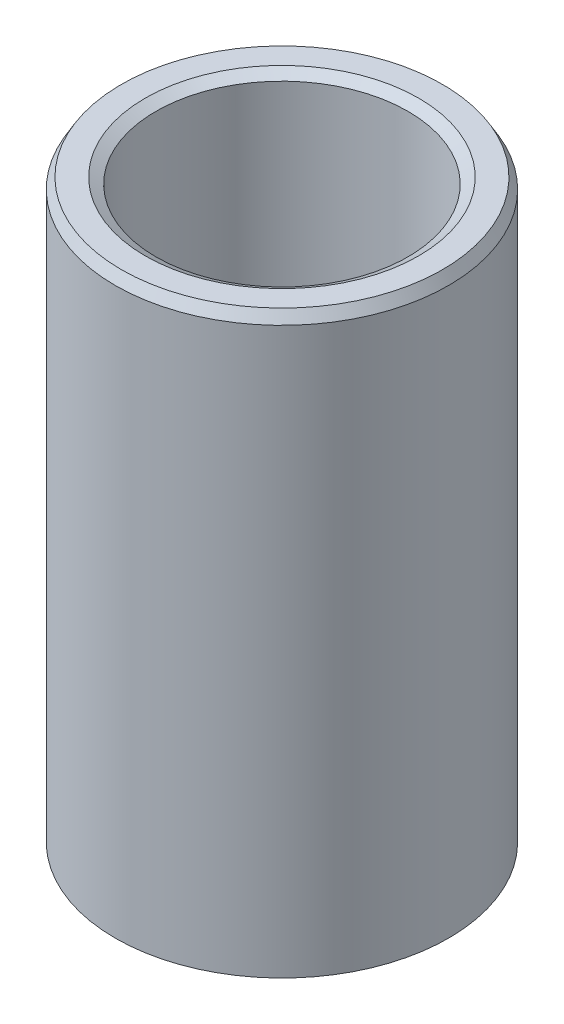
ISO-10303-21;
HEADER;
FILE_DESCRIPTION(('STEP AP214'),'2;1');
FILE_NAME('part.step','',(''),(''),'','','');
FILE_SCHEMA(('AUTOMOTIVE_DESIGN { 1 0 10303 214 1 1 1 1 }'));
ENDSEC;
DATA;
#1=APPLICATION_CONTEXT('core data for automotive mechanical design processes');
#2=APPLICATION_PROTOCOL_DEFINITION('international standard','automotive_design',2000,#1);
#3=PRODUCT_CONTEXT('',#1,'mechanical');
#4=PRODUCT('Part','Part','',(#3));
#5=PRODUCT_RELATED_PRODUCT_CATEGORY('part','',(#4));
#6=PRODUCT_DEFINITION_FORMATION('','',#4);
#7=PRODUCT_DEFINITION_CONTEXT('part definition',#1,'design');
#8=PRODUCT_DEFINITION('design','',#6,#7);
#9=PRODUCT_DEFINITION_SHAPE('','',#8);
#10=(LENGTH_UNIT() NAMED_UNIT(*) SI_UNIT(.MILLI.,.METRE.));
#11=(NAMED_UNIT(*) PLANE_ANGLE_UNIT() SI_UNIT($,.RADIAN.));
#12=(NAMED_UNIT(*) SI_UNIT($,.STERADIAN.) SOLID_ANGLE_UNIT());
#13=UNCERTAINTY_MEASURE_WITH_UNIT(LENGTH_MEASURE(1.E-05),#10,'distance_accuracy_value','');
#14=(GEOMETRIC_REPRESENTATION_CONTEXT(3) GLOBAL_UNCERTAINTY_ASSIGNED_CONTEXT((#13)) GLOBAL_UNIT_ASSIGNED_CONTEXT((#10,
#11,#12)) REPRESENTATION_CONTEXT('',''));
#15=CARTESIAN_POINT('',(0.,0.,0.));
#16=DIRECTION('',(0.,0.,1.));
#17=DIRECTION('',(1.,0.,0.));
#18=AXIS2_PLACEMENT_3D('',#15,#16,#17);
#19=CARTESIAN_POINT('',(0.,209.52216487062,0.));
#20=DIRECTION('',(0.,-1.,0.));
#21=DIRECTION('',(0.,0.,-1.));
#22=AXIS2_PLACEMENT_3D('',#19,#20,#21);
#23=CYLINDRICAL_SURFACE('',#22,60.);
#24=CARTESIAN_POINT('',(0.,2.20777962738306,0.));
#25=DIRECTION('',(0.,1.,0.));
#26=DIRECTION('',(0.,0.,1.));
#27=AXIS2_PLACEMENT_3D('',#24,#25,#26);
#28=CIRCLE('',#27,60.);
#29=CARTESIAN_POINT('',(0.,2.20777962738306,60.));
#30=VERTEX_POINT('',#29);
#31=EDGE_CURVE('E10',#30,#30,#28,.T.);
#32=ORIENTED_EDGE('',*,*,#31,.T.);
#33=EDGE_LOOP('',(#32));
#34=FACE_BOUND('',#33,.T.);
#35=CARTESIAN_POINT('',(0.,205.698178384077,0.));
#36=DIRECTION('',(0.,1.,0.));
#37=DIRECTION('',(0.,0.,1.));
#38=AXIS2_PLACEMENT_3D('',#35,#36,#37);
#39=CIRCLE('',#38,60.);
#40=CARTESIAN_POINT('',(0.,205.698178384077,60.));
#41=VERTEX_POINT('',#40);
#42=EDGE_CURVE('E50',#41,#41,#39,.F.);
#43=ORIENTED_EDGE('',*,*,#42,.T.);
#44=EDGE_LOOP('',(#43));
#45=FACE_BOUND('',#44,.T.);
#46=ADVANCED_FACE('F39',(#34,#45),#23,.T.);
#47=CARTESIAN_POINT('',(0.,209.52216487062,0.));
#48=DIRECTION('',(0.,1.,0.));
#49=DIRECTION('',(0.,0.,1.));
#50=AXIS2_PLACEMENT_3D('',#47,#48,#49);
#51=PLANE('',#50);
#52=CARTESIAN_POINT('',(0.,209.52216487062,0.));
#53=DIRECTION('',(0.,1.,0.));
#54=DIRECTION('',(0.,0.,1.));
#55=AXIS2_PLACEMENT_3D('',#52,#53,#54);
#56=CIRCLE('',#55,49.2090341574761);
#57=CARTESIAN_POINT('',(0.,209.52216487062,49.2090341574761));
#58=VERTEX_POINT('',#57);
#59=EDGE_CURVE('E58',#58,#58,#56,.F.);
#60=ORIENTED_EDGE('',*,*,#59,.T.);
#61=EDGE_LOOP('',(#60));
#62=FACE_BOUND('',#61,.T.);
#63=CARTESIAN_POINT('',(0.,209.52216487062,0.));
#64=DIRECTION('',(0.,1.,0.));
#65=DIRECTION('',(0.,0.,1.));
#66=AXIS2_PLACEMENT_3D('',#63,#64,#65);
#67=CIRCLE('',#66,57.7922203726169);
#68=CARTESIAN_POINT('',(0.,209.52216487062,57.7922203726169));
#69=VERTEX_POINT('',#68);
#70=EDGE_CURVE('E61',#69,#69,#67,.T.);
#71=ORIENTED_EDGE('',*,*,#70,.T.);
#72=EDGE_LOOP('',(#71));
#73=FACE_BOUND('',#72,.T.);
#74=ADVANCED_FACE('F88',(#62,#73),#51,.T.);
#75=CARTESIAN_POINT('',(0.,0.,0.));
#76=DIRECTION('',(0.,1.,0.));
#77=DIRECTION('',(0.,0.,1.));
#78=AXIS2_PLACEMENT_3D('',#75,#76,#77);
#79=PLANE('',#78);
#80=CARTESIAN_POINT('',(0.,0.,0.));
#81=DIRECTION('',(0.,1.,0.));
#82=DIRECTION('',(0.,0.,1.));
#83=AXIS2_PLACEMENT_3D('',#80,#81,#82);
#84=CIRCLE('',#83,47.5928272983162);
#85=CARTESIAN_POINT('',(0.,0.,-47.5928272983162));
#86=VERTEX_POINT('',#85);
#87=EDGE_CURVE('E51',#86,#86,#84,.T.);
#88=ORIENTED_EDGE('',*,*,#87,.T.);
#89=EDGE_LOOP('',(#88));
#90=FACE_BOUND('',#89,.T.);
#91=CARTESIAN_POINT('',(0.,0.,0.));
#92=DIRECTION('',(0.,1.,0.));
#93=DIRECTION('',(0.,0.,1.));
#94=AXIS2_PLACEMENT_3D('',#91,#92,#93);
#95=CIRCLE('',#94,56.176013513457);
#96=CARTESIAN_POINT('',(0.,0.,56.176013513457));
#97=VERTEX_POINT('',#96);
#98=EDGE_CURVE('E54',#97,#97,#95,.F.);
#99=ORIENTED_EDGE('',*,*,#98,.T.);
#100=EDGE_LOOP('',(#99));
#101=FACE_BOUND('',#100,.T.);
#102=ADVANCED_FACE('F83',(#90,#101),#79,.F.);
#103=CARTESIAN_POINT('',(0.,209.52216487062,0.));
#104=DIRECTION('',(0.,-1.,0.));
#105=DIRECTION('',(0.,0.,-1.));
#106=AXIS2_PLACEMENT_3D('',#103,#104,#105);
#107=CYLINDRICAL_SURFACE('',#106,45.3850476709331);
#108=CARTESIAN_POINT('',(0.,207.314385243237,0.));
#109=DIRECTION('',(0.,1.,0.));
#110=DIRECTION('',(0.,0.,1.));
#111=AXIS2_PLACEMENT_3D('',#108,#109,#110);
#112=CIRCLE('',#111,45.3850476709331);
#113=CARTESIAN_POINT('',(0.,207.314385243237,45.3850476709331));
#114=VERTEX_POINT('',#113);
#115=EDGE_CURVE('E67',#114,#114,#112,.T.);
#116=ORIENTED_EDGE('',*,*,#115,.T.);
#117=EDGE_LOOP('',(#116));
#118=FACE_BOUND('',#117,.T.);
#119=CARTESIAN_POINT('',(0.,3.82398648654297,0.));
#120=DIRECTION('',(0.,1.,0.));
#121=DIRECTION('',(0.,0.,1.));
#122=AXIS2_PLACEMENT_3D('',#119,#120,#121);
#123=CIRCLE('',#122,45.3850476709331);
#124=CARTESIAN_POINT('',(0.,3.82398648654297,-45.3850476709331));
#125=VERTEX_POINT('',#124);
#126=EDGE_CURVE('E69',#125,#125,#123,.F.);
#127=ORIENTED_EDGE('',*,*,#126,.T.);
#128=EDGE_LOOP('',(#127));
#129=FACE_BOUND('',#128,.T.);
#130=ADVANCED_FACE('F71',(#118,#129),#107,.F.);
#131=CARTESIAN_POINT('',(0.,207.314385243237,0.));
#132=DIRECTION('',(0.,1.,0.));
#133=DIRECTION('',(0.,0.,1.));
#134=AXIS2_PLACEMENT_3D('',#131,#132,#133);
#135=CONICAL_SURFACE('',#134,45.3850476709331,1.0471975511966);
#136=ORIENTED_EDGE('',*,*,#59,.F.);
#137=EDGE_LOOP('',(#136));
#138=FACE_BOUND('',#137,.T.);
#139=ORIENTED_EDGE('',*,*,#115,.F.);
#140=EDGE_LOOP('',(#139));
#141=FACE_BOUND('',#140,.T.);
#142=ADVANCED_FACE('F77',(#138,#141),#135,.F.);
#143=CARTESIAN_POINT('',(0.,0.,0.));
#144=DIRECTION('',(0.,-1.,0.));
#145=DIRECTION('',(0.,0.,-1.));
#146=AXIS2_PLACEMENT_3D('',#143,#144,#145);
#147=CONICAL_SURFACE('',#146,47.5928272983162,0.523598775598292);
#148=CARTESIAN_POINT('',(0.,3.82398648654297,-45.3850476709331));
#149=CARTESIAN_POINT('',(0.,3.78415329397482,-45.408045375385));
#150=CARTESIAN_POINT('',(0.,3.74432010140666,-45.4310430798369));
#151=CARTESIAN_POINT('',(0.,3.66465371627035,-45.4770384887407));
#152=CARTESIAN_POINT('',(0.,3.62482052370219,-45.5000361931926));
#153=CARTESIAN_POINT('',(0.,3.54515413856588,-45.5460316020965));
#154=CARTESIAN_POINT('',(0.,3.50532094599773,-45.5690293065484));
#155=CARTESIAN_POINT('',(0.,3.42565456086141,-45.6150247154522));
#156=CARTESIAN_POINT('',(0.,3.38582136829326,-45.6380224199041));
#157=CARTESIAN_POINT('',(0.,3.30615498315695,-45.6840178288079));
#158=CARTESIAN_POINT('',(0.,3.26632179058879,-45.7070155332598));
#159=CARTESIAN_POINT('',(0.,3.18665540545248,-45.7530109421636));
#160=CARTESIAN_POINT('',(0.,3.14682221288432,-45.7760086466155));
#161=CARTESIAN_POINT('',(0.,3.06715582774801,-45.8220040555193));
#162=CARTESIAN_POINT('',(0.,3.02732263517985,-45.8450017599712));
#163=CARTESIAN_POINT('',(0.,2.94765625004354,-45.8909971688751));
#164=CARTESIAN_POINT('',(0.,2.90782305747539,-45.913994873327));
#165=CARTESIAN_POINT('',(0.,2.82815667233907,-45.9599902822308));
#166=CARTESIAN_POINT('',(0.,2.78832347977092,-45.9829879866827));
#167=CARTESIAN_POINT('',(0.,2.70865709463461,-46.0289833955865));
#168=CARTESIAN_POINT('',(0.,2.66882390206645,-46.0519811000384));
#169=CARTESIAN_POINT('',(0.,2.58915751693014,-46.0979765089422));
#170=CARTESIAN_POINT('',(0.,2.54932432436198,-46.1209742133941));
#171=CARTESIAN_POINT('',(0.,2.46965793922567,-46.1669696222979));
#172=CARTESIAN_POINT('',(0.,2.42982474665751,-46.1899673267499));
#173=CARTESIAN_POINT('',(0.,2.3501583615212,-46.2359627356537));
#174=CARTESIAN_POINT('',(0.,2.31032516895305,-46.2589604401056));
#175=CARTESIAN_POINT('',(0.,2.23065878381674,-46.3049558490094));
#176=CARTESIAN_POINT('',(0.,2.19082559124858,-46.3279535534613));
#177=CARTESIAN_POINT('',(0.,2.11115920611227,-46.3739489623651));
#178=CARTESIAN_POINT('',(0.,2.07132601354411,-46.396946666817));
#179=CARTESIAN_POINT('',(0.,1.9916596284078,-46.4429420757208));
#180=CARTESIAN_POINT('',(0.,1.95182643583964,-46.4659397801727));
#181=CARTESIAN_POINT('',(0.,1.87216005070333,-46.5119351890765));
#182=CARTESIAN_POINT('',(0.,1.83232685813517,-46.5349328935284));
#183=CARTESIAN_POINT('',(0.,1.75266047299886,-46.5809283024323));
#184=CARTESIAN_POINT('',(0.,1.71282728043071,-46.6039260068842));
#185=CARTESIAN_POINT('',(0.,1.6331608952944,-46.649921415788));
#186=CARTESIAN_POINT('',(0.,1.59332770272624,-46.6729191202399));
#187=CARTESIAN_POINT('',(0.,1.51366131758993,-46.7189145291437));
#188=CARTESIAN_POINT('',(0.,1.47382812502177,-46.7419122335956));
#189=CARTESIAN_POINT('',(0.,1.39416173988546,-46.7879076424994));
#190=CARTESIAN_POINT('',(0.,1.3543285473173,-46.8109053469513));
#191=CARTESIAN_POINT('',(0.,1.27466216218099,-46.8569007558551));
#192=CARTESIAN_POINT('',(0.,1.23482896961284,-46.879898460307));
#193=CARTESIAN_POINT('',(0.,1.15516258447652,-46.9258938692109));
#194=CARTESIAN_POINT('',(0.,1.11532939190837,-46.9488915736628));
#195=CARTESIAN_POINT('',(0.,1.03566300677205,-46.9948869825666));
#196=CARTESIAN_POINT('',(0.,0.995829814203899,-47.0178846870185));
#197=CARTESIAN_POINT('',(0.,0.916163429067587,-47.0638800959223));
#198=CARTESIAN_POINT('',(0.,0.876330236499432,-47.0868778003742));
#199=CARTESIAN_POINT('',(0.,0.79666385136312,-47.132873209278));
#200=CARTESIAN_POINT('',(0.,0.756830658794963,-47.1558709137299));
#201=CARTESIAN_POINT('',(0.,0.677164273658651,-47.2018663226337));
#202=CARTESIAN_POINT('',(0.,0.637331081090496,-47.2248640270856));
#203=CARTESIAN_POINT('',(0.,0.557664695954184,-47.2708594359895));
#204=CARTESIAN_POINT('',(0.,0.517831503386027,-47.2938571404414));
#205=CARTESIAN_POINT('',(0.,0.438165118249715,-47.3398525493452));
#206=CARTESIAN_POINT('',(0.,0.39833192568156,-47.3628502537971));
#207=CARTESIAN_POINT('',(0.,0.318665540545248,-47.4088456627009));
#208=CARTESIAN_POINT('',(0.,0.278832347977091,-47.4318433671528));
#209=CARTESIAN_POINT('',(0.,0.199165962840779,-47.4778387760566));
#210=CARTESIAN_POINT('',(0.,0.159332770272624,-47.5008364805085));
#211=CARTESIAN_POINT('',(0.,0.079666385136313,-47.5468318894123));
#212=CARTESIAN_POINT('',(0.,0.0398331925681576,-47.5698295938642));
#213=CARTESIAN_POINT('',(0.,0.,-47.5928272983162));
#214=B_SPLINE_CURVE_WITH_KNOTS('',3,(#148,#149,#150,#151,#152,#153,#154,#155,#156,#157,#158,
#159,#160,#161,#162,#163,#164,#165,#166,#167,#168,#169,#170,#171,#172,#173,#174,#175,#176,#177,
#178,#179,#180,#181,#182,#183,#184,#185,#186,#187,#188,#189,#190,#191,#192,#193,#194,#195,#196,
#197,#198,#199,#200,#201,#202,#203,#204,#205,#206,#207,#208,#209,#210,#211,#212,#213),
.UNSPECIFIED.,.F.,.F.,(4,2,2,2,2,2,2,2,2,2,2,2,2,2,2,2,2,2,2,2,2,2,2,2,2,2,2,2,2,2,2,2,4),(0.,
0.13798622671144,0.275972453422884,0.413958680134324,0.551944906845768,0.689931133557208,
0.827917360268652,0.965903586980092,1.10388981369153,1.24187604040298,1.37986226711442,
1.51784849382586,1.6558347205373,1.79382094724874,1.93180717396018,2.06979340067163,
2.20777962738307,2.34576585409451,2.48375208080595,2.62173830751739,2.75972453422884,
2.89771076094028,3.03569698765172,3.17368321436316,3.3116694410746,3.44965566778604,
3.58764189449748,3.72562812120893,3.86361434792037,4.00160057463181,4.13958680134325,
4.27757302805469,4.41555925476613),.UNSPECIFIED.);
#215=EDGE_CURVE('BSEAM73',#125,#86,#214,.T.);
#216=ORIENTED_EDGE('',*,*,#126,.F.);
#217=ORIENTED_EDGE('',*,*,#87,.F.);
#218=ORIENTED_EDGE('',*,*,#215,.T.);
#219=ORIENTED_EDGE('',*,*,#215,.F.);
#220=EDGE_LOOP('',(#216,#218,#217,#219));
#221=FACE_BOUND('',#220,.T.);
#222=ADVANCED_FACE('F73',(#221),#147,.F.);
#223=CARTESIAN_POINT('',(0.,2.20777962738306,0.));
#224=DIRECTION('',(0.,1.,0.));
#225=DIRECTION('',(0.,0.,1.));
#226=AXIS2_PLACEMENT_3D('',#223,#224,#225);
#227=CONICAL_SURFACE('',#226,60.,1.0471975511966);
#228=ORIENTED_EDGE('',*,*,#98,.F.);
#229=EDGE_LOOP('',(#228));
#230=FACE_BOUND('',#229,.T.);
#231=ORIENTED_EDGE('',*,*,#31,.F.);
#232=EDGE_LOOP('',(#231));
#233=FACE_BOUND('',#232,.T.);
#234=ADVANCED_FACE('F76',(#230,#233),#227,.T.);
#235=CARTESIAN_POINT('',(0.,209.52216487062,0.));
#236=DIRECTION('',(0.,-1.,0.));
#237=DIRECTION('',(0.,0.,-1.));
#238=AXIS2_PLACEMENT_3D('',#235,#236,#237);
#239=CONICAL_SURFACE('',#238,57.7922203726169,0.523598775598294);
#240=ORIENTED_EDGE('',*,*,#42,.F.);
#241=EDGE_LOOP('',(#240));
#242=FACE_BOUND('',#241,.T.);
#243=ORIENTED_EDGE('',*,*,#70,.F.);
#244=EDGE_LOOP('',(#243));
#245=FACE_BOUND('',#244,.T.);
#246=ADVANCED_FACE('F45',(#242,#245),#239,.T.);
#247=CLOSED_SHELL('',(#46,#74,#102,#130,#142,#222,#234,#246));
#248=MANIFOLD_SOLID_BREP('B2',#247);
#249=ADVANCED_BREP_SHAPE_REPRESENTATION('',(#18,#248),#14);
#250=SHAPE_DEFINITION_REPRESENTATION(#9,#249);
ENDSEC;
END-ISO-10303-21;
